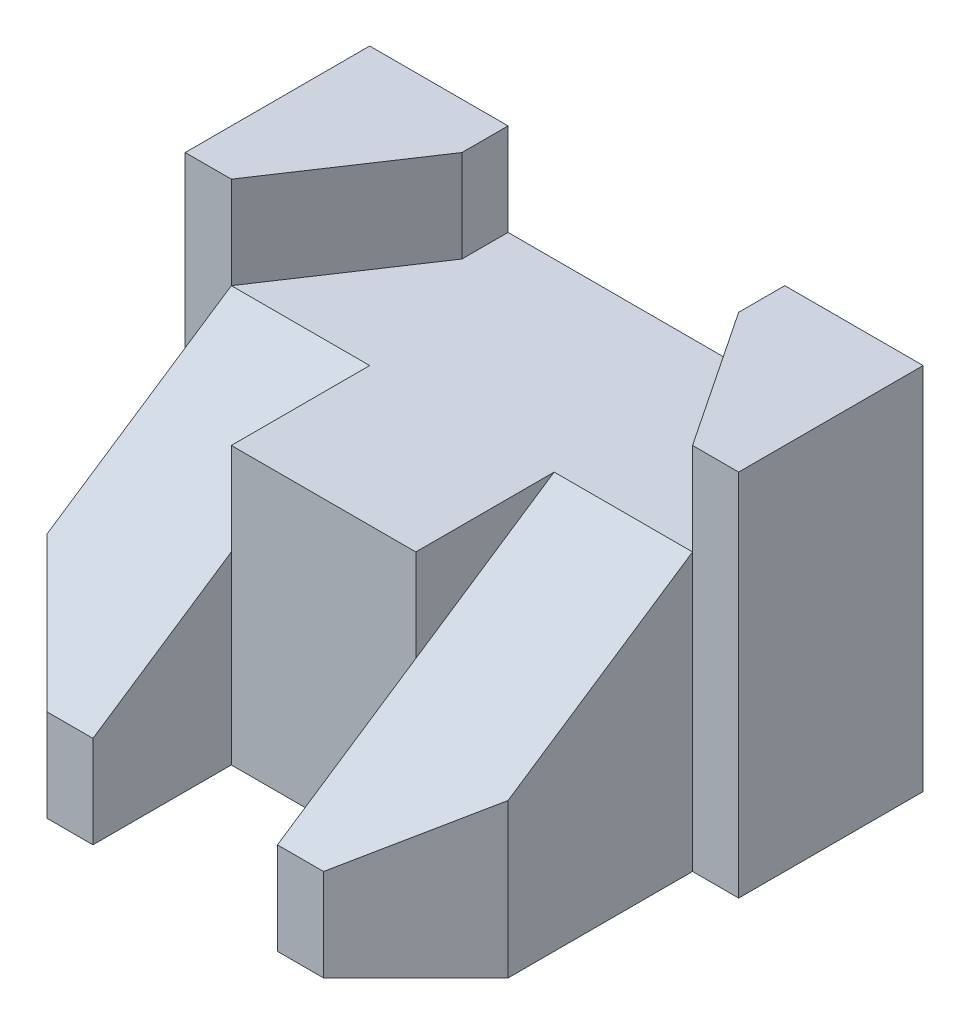
ISO-10303-21;
HEADER;
FILE_DESCRIPTION(('STEP AP214'),'2;1');
FILE_NAME('part.step','',(''),(''),'','','');
FILE_SCHEMA(('AUTOMOTIVE_DESIGN { 1 0 10303 214 1 1 1 1 }'));
ENDSEC;
DATA;
#1=APPLICATION_CONTEXT('core data for automotive mechanical design processes');
#2=APPLICATION_PROTOCOL_DEFINITION('international standard','automotive_design',2000,#1);
#3=PRODUCT_CONTEXT('',#1,'mechanical');
#4=PRODUCT('Part','Part','',(#3));
#5=PRODUCT_RELATED_PRODUCT_CATEGORY('part','',(#4));
#6=PRODUCT_DEFINITION_FORMATION('','',#4);
#7=PRODUCT_DEFINITION_CONTEXT('part definition',#1,'design');
#8=PRODUCT_DEFINITION('design','',#6,#7);
#9=PRODUCT_DEFINITION_SHAPE('','',#8);
#10=(LENGTH_UNIT() NAMED_UNIT(*) SI_UNIT(.MILLI.,.METRE.));
#11=(NAMED_UNIT(*) PLANE_ANGLE_UNIT() SI_UNIT($,.RADIAN.));
#12=(NAMED_UNIT(*) SI_UNIT($,.STERADIAN.) SOLID_ANGLE_UNIT());
#13=UNCERTAINTY_MEASURE_WITH_UNIT(LENGTH_MEASURE(1.E-05),#10,'distance_accuracy_value','');
#14=(GEOMETRIC_REPRESENTATION_CONTEXT(3) GLOBAL_UNCERTAINTY_ASSIGNED_CONTEXT((#13)) GLOBAL_UNIT_ASSIGNED_CONTEXT((#10,
#11,#12)) REPRESENTATION_CONTEXT('',''));
#15=CARTESIAN_POINT('',(0.,0.,0.));
#16=DIRECTION('',(0.,0.,1.));
#17=DIRECTION('',(1.,0.,0.));
#18=AXIS2_PLACEMENT_3D('',#15,#16,#17);
#19=CARTESIAN_POINT('',(0.,60.,0.));
#20=DIRECTION('',(0.,-1.,0.));
#21=DIRECTION('',(0.,0.,-1.));
#22=AXIS2_PLACEMENT_3D('',#19,#20,#21);
#23=PLANE('',#22);
#24=DIRECTION('',(1.,0.,0.));
#25=VECTOR('',#24,1.);
#26=CARTESIAN_POINT('',(80.,60.,-30.));
#27=LINE('',#26,#25);
#28=CARTESIAN_POINT('',(40.0006538410258,60.,-30.));
#29=VERTEX_POINT('',#28);
#30=CARTESIAN_POINT('',(80.,60.,-30.));
#31=VERTEX_POINT('',#30);
#32=EDGE_CURVE('E326',#29,#31,#27,.T.);
#33=ORIENTED_EDGE('',*,*,#32,.T.);
#34=DIRECTION('',(0.,0.,-1.));
#35=VECTOR('',#34,1.);
#36=CARTESIAN_POINT('',(80.,60.,0.));
#37=LINE('',#36,#35);
#38=CARTESIAN_POINT('',(80.,60.,-60.));
#39=VERTEX_POINT('',#38);
#40=EDGE_CURVE('E308',#31,#39,#37,.T.);
#41=ORIENTED_EDGE('',*,*,#40,.T.);
#42=DIRECTION('',(1.,0.,0.));
#43=VECTOR('',#42,1.);
#44=CARTESIAN_POINT('',(80.,60.,-60.));
#45=LINE('',#44,#43);
#46=CARTESIAN_POINT('',(109.999,60.,-60.));
#47=VERTEX_POINT('',#46);
#48=EDGE_CURVE('E393',#39,#47,#45,.T.);
#49=ORIENTED_EDGE('',*,*,#48,.T.);
#50=DIRECTION('',(-0.554680994621482,0.,-0.832063095086979));
#51=VECTOR('',#50,1.);
#52=CARTESIAN_POINT('',(109.999,60.,-60.));
#53=LINE('',#52,#51);
#54=CARTESIAN_POINT('',(90.,60.,-90.));
#55=VERTEX_POINT('',#54);
#56=EDGE_CURVE('E328',#47,#55,#53,.T.);
#57=ORIENTED_EDGE('',*,*,#56,.T.);
#58=DIRECTION('',(0.,0.,-1.));
#59=VECTOR('',#58,1.);
#60=CARTESIAN_POINT('',(90.,60.,-100.));
#61=LINE('',#60,#59);
#62=CARTESIAN_POINT('',(90.,60.,-100.));
#63=VERTEX_POINT('',#62);
#64=EDGE_CURVE('E331',#55,#63,#61,.T.);
#65=ORIENTED_EDGE('',*,*,#64,.T.);
#66=DIRECTION('',(-1.,0.,0.));
#67=VECTOR('',#66,1.);
#68=CARTESIAN_POINT('',(30.,60.,-100.));
#69=LINE('',#68,#67);
#70=CARTESIAN_POINT('',(30.,60.,-100.));
#71=VERTEX_POINT('',#70);
#72=EDGE_CURVE('E334',#63,#71,#69,.T.);
#73=ORIENTED_EDGE('',*,*,#72,.T.);
#74=DIRECTION('',(0.,0.,1.));
#75=VECTOR('',#74,1.);
#76=CARTESIAN_POINT('',(30.,60.,-90.));
#77=LINE('',#76,#75);
#78=CARTESIAN_POINT('',(30.,60.,-90.));
#79=VERTEX_POINT('',#78);
#80=EDGE_CURVE('E322',#71,#79,#77,.T.);
#81=ORIENTED_EDGE('',*,*,#80,.T.);
#82=DIRECTION('',(-0.554680994621483,0.,0.832063095086979));
#83=VECTOR('',#82,1.);
#84=CARTESIAN_POINT('',(10.001,60.,-60.));
#85=LINE('',#84,#83);
#86=CARTESIAN_POINT('',(10.001,60.,-60.));
#87=VERTEX_POINT('',#86);
#88=EDGE_CURVE('E306',#79,#87,#85,.T.);
#89=ORIENTED_EDGE('',*,*,#88,.T.);
#90=DIRECTION('',(-1.,0.,-5.55543559704748E-10));
#91=VECTOR('',#90,1.);
#92=CARTESIAN_POINT('',(10.,59.9999999999997,-60.0000000000002));
#93=LINE('',#92,#91);
#94=CARTESIAN_POINT('',(40.001,60.,-59.9999999833333));
#95=VERTEX_POINT('',#94);
#96=EDGE_CURVE('E296',#95,#87,#93,.T.);
#97=ORIENTED_EDGE('',*,*,#96,.F.);
#98=DIRECTION('',(1.15386324790428E-05,0.,-0.99999999993343));
#99=VECTOR('',#98,1.);
#100=CARTESIAN_POINT('',(40.0003076767258,60.,0.000461548849361099));
#101=LINE('',#100,#99);
#102=EDGE_CURVE('E41',#29,#95,#101,.T.);
#103=ORIENTED_EDGE('',*,*,#102,.F.);
#104=EDGE_LOOP('',(#33,#41,#49,#57,#65,#73,#81,#89,#97,#103));
#105=FACE_BOUND('',#104,.T.);
#106=ADVANCED_FACE('F33',(#105),#23,.F.);
#107=CARTESIAN_POINT('',(0.,80.,0.));
#108=DIRECTION('',(0.,0.,-1.));
#109=DIRECTION('',(-1.,0.,0.));
#110=AXIS2_PLACEMENT_3D('',#107,#108,#109);
#111=PLANE('',#110);
#112=DIRECTION('',(1.,2.56410402169986E-10,1.70940056091566E-10));
#113=VECTOR('',#112,1.);
#114=CARTESIAN_POINT('',(40.,20.,0.));
#115=LINE('',#114,#113);
#116=CARTESIAN_POINT('',(29.9999999982906,19.9999999974359,-1.70940374138813E-09));
#117=VERTEX_POINT('',#116);
#118=CARTESIAN_POINT('',(40.,20.,0.));
#119=VERTEX_POINT('',#118);
#120=EDGE_CURVE('E301',#117,#119,#115,.T.);
#121=ORIENTED_EDGE('',*,*,#120,.F.);
#122=DIRECTION('',(0.,1.,0.));
#123=VECTOR('',#122,1.);
#124=CARTESIAN_POINT('',(30.,0.,0.));
#125=LINE('',#124,#123);
#126=CARTESIAN_POINT('',(30.,0.,0.));
#127=VERTEX_POINT('',#126);
#128=EDGE_CURVE('E223',#127,#117,#125,.T.);
#129=ORIENTED_EDGE('',*,*,#128,.F.);
#130=DIRECTION('',(1.,0.,0.));
#131=VECTOR('',#130,1.);
#132=CARTESIAN_POINT('',(0.,0.,0.));
#133=LINE('',#132,#131);
#134=CARTESIAN_POINT('',(40.,0.,0.));
#135=VERTEX_POINT('',#134);
#136=EDGE_CURVE('E273',#127,#135,#133,.T.);
#137=ORIENTED_EDGE('',*,*,#136,.T.);
#138=DIRECTION('',(0.,1.,0.));
#139=VECTOR('',#138,1.);
#140=CARTESIAN_POINT('',(40.,0.,0.));
#141=LINE('',#140,#139);
#142=EDGE_CURVE('E250',#135,#119,#141,.T.);
#143=ORIENTED_EDGE('',*,*,#142,.T.);
#144=EDGE_LOOP('',(#121,#129,#137,#143));
#145=FACE_BOUND('',#144,.T.);
#146=ADVANCED_FACE('F415',(#145),#111,.F.);
#147=CARTESIAN_POINT('',(40.,0.,0.));
#148=DIRECTION('',(-1.,0.,0.));
#149=DIRECTION('',(0.,0.,1.));
#150=AXIS2_PLACEMENT_3D('',#147,#148,#149);
#151=PLANE('',#150);
#152=DIRECTION('',(0.,0.554700196331898,-0.832050294266731));
#153=VECTOR('',#152,1.);
#154=CARTESIAN_POINT('',(40.,13.8461538437871,9.2307692317554));
#155=LINE('',#154,#153);
#156=CARTESIAN_POINT('',(40.,40.0000000055554,-30.));
#157=VERTEX_POINT('',#156);
#158=EDGE_CURVE('E318',#119,#157,#155,.T.);
#159=ORIENTED_EDGE('',*,*,#158,.F.);
#160=ORIENTED_EDGE('',*,*,#142,.F.);
#161=DIRECTION('',(0.,0.,1.));
#162=VECTOR('',#161,1.);
#163=CARTESIAN_POINT('',(40.,0.,0.));
#164=LINE('',#163,#162);
#165=CARTESIAN_POINT('',(40.,0.,-30.));
#166=VERTEX_POINT('',#165);
#167=EDGE_CURVE('E242',#166,#135,#164,.T.);
#168=ORIENTED_EDGE('',*,*,#167,.F.);
#169=DIRECTION('',(0.,1.,0.));
#170=VECTOR('',#169,1.);
#171=CARTESIAN_POINT('',(40.,0.,-30.));
#172=LINE('',#171,#170);
#173=EDGE_CURVE('E253',#166,#157,#172,.T.);
#174=ORIENTED_EDGE('',*,*,#173,.T.);
#175=EDGE_LOOP('',(#159,#160,#168,#174));
#176=FACE_BOUND('',#175,.T.);
#177=ADVANCED_FACE('F412',(#176),#151,.F.);
#178=CARTESIAN_POINT('',(80.,0.,-30.));
#179=DIRECTION('',(0.,0.,-1.));
#180=DIRECTION('',(-1.,0.,0.));
#181=AXIS2_PLACEMENT_3D('',#178,#179,#180);
#182=PLANE('',#181);
#183=DIRECTION('',(7.69205128471533E-06,0.999999999970416,0.));
#184=VECTOR('',#183,1.);
#185=CARTESIAN_POINT('',(40.0001923203154,0.000307680572059986,-30.));
#186=LINE('',#185,#184);
#187=CARTESIAN_POINT('',(40.0005000000002,40.0000000055555,-30.));
#188=VERTEX_POINT('',#187);
#189=EDGE_CURVE('E289',#188,#29,#186,.T.);
#190=ORIENTED_EDGE('',*,*,#189,.F.);
#191=DIRECTION('',(1.,3.70370988747382E-10,0.));
#192=VECTOR('',#191,1.);
#193=CARTESIAN_POINT('',(79.9999999851852,40.0000000203702,-30.));
#194=LINE('',#193,#192);
#195=EDGE_CURVE('E299',#157,#188,#194,.T.);
#196=ORIENTED_EDGE('',*,*,#195,.F.);
#197=ORIENTED_EDGE('',*,*,#173,.F.);
#198=DIRECTION('',(-1.,0.,0.));
#199=VECTOR('',#198,1.);
#200=CARTESIAN_POINT('',(80.,0.,-30.));
#201=LINE('',#200,#199);
#202=CARTESIAN_POINT('',(80.,0.,-30.));
#203=VERTEX_POINT('',#202);
#204=EDGE_CURVE('E239',#203,#166,#201,.T.);
#205=ORIENTED_EDGE('',*,*,#204,.F.);
#206=DIRECTION('',(0.,1.,0.));
#207=VECTOR('',#206,1.);
#208=CARTESIAN_POINT('',(80.,0.,-30.));
#209=LINE('',#208,#207);
#210=CARTESIAN_POINT('',(80.,40.,-30.));
#211=VERTEX_POINT('',#210);
#212=EDGE_CURVE('E256',#203,#211,#209,.T.);
#213=ORIENTED_EDGE('',*,*,#212,.T.);
#214=EDGE_CURVE('E245',#211,#31,#209,.T.);
#215=ORIENTED_EDGE('',*,*,#214,.T.);
#216=ORIENTED_EDGE('',*,*,#32,.F.);
#217=EDGE_LOOP('',(#190,#196,#197,#205,#213,#215,#216));
#218=FACE_BOUND('',#217,.T.);
#219=ADVANCED_FACE('F404',(#218),#182,.F.);
#220=CARTESIAN_POINT('',(10.,0.,-60.));
#221=DIRECTION('',(1.,0.,0.));
#222=DIRECTION('',(0.,0.,-1.));
#223=AXIS2_PLACEMENT_3D('',#220,#221,#222);
#224=PLANE('',#223);
#225=DIRECTION('',(0.,-0.554700196331898,0.832050294266731));
#226=VECTOR('',#225,1.);
#227=CARTESIAN_POINT('',(10.,19.9999999923077,-5.12820341747044E-09));
#228=LINE('',#227,#226);
#229=CARTESIAN_POINT('',(10.,59.9999999999997,-60.0000000000002));
#230=VERTEX_POINT('',#229);
#231=CARTESIAN_POINT('',(10.,33.3333333259258,-20.));
#232=VERTEX_POINT('',#231);
#233=EDGE_CURVE('E307',#230,#232,#228,.T.);
#234=ORIENTED_EDGE('',*,*,#233,.F.);
#235=DIRECTION('',(0.,1.,0.));
#236=VECTOR('',#235,1.);
#237=CARTESIAN_POINT('',(10.,0.,-60.));
#238=LINE('',#237,#236);
#239=CARTESIAN_POINT('',(10.,0.,-60.));
#240=VERTEX_POINT('',#239);
#241=EDGE_CURVE('E229',#240,#230,#238,.T.);
#242=ORIENTED_EDGE('',*,*,#241,.F.);
#243=DIRECTION('',(0.,0.,-1.));
#244=VECTOR('',#243,1.);
#245=CARTESIAN_POINT('',(10.,0.,-60.));
#246=LINE('',#245,#244);
#247=CARTESIAN_POINT('',(10.,0.,-20.));
#248=VERTEX_POINT('',#247);
#249=EDGE_CURVE('E216',#248,#240,#246,.T.);
#250=ORIENTED_EDGE('',*,*,#249,.F.);
#251=DIRECTION('',(0.,1.,0.));
#252=VECTOR('',#251,1.);
#253=CARTESIAN_POINT('',(10.,0.,-20.));
#254=LINE('',#253,#252);
#255=EDGE_CURVE('E232',#248,#232,#254,.T.);
#256=ORIENTED_EDGE('',*,*,#255,.T.);
#257=EDGE_LOOP('',(#234,#242,#250,#256));
#258=FACE_BOUND('',#257,.T.);
#259=ADVANCED_FACE('F425',(#258),#224,.F.);
#260=CARTESIAN_POINT('',(10.,0.,-20.));
#261=DIRECTION('',(0.707106781186548,0.,-0.707106781186548));
#262=DIRECTION('',(-0.707106781186548,0.,-0.707106781186548));
#263=AXIS2_PLACEMENT_3D('',#260,#261,#262);
#264=PLANE('',#263);
#265=DIRECTION('',(0.639602149099136,-0.426401432614308,0.639602149099136));
#266=VECTOR('',#265,1.);
#267=CARTESIAN_POINT('',(19.0909090872818,27.2727272694215,-10.9090909127182));
#268=LINE('',#267,#266);
#269=EDGE_CURVE('E300',#232,#117,#268,.T.);
#270=ORIENTED_EDGE('',*,*,#269,.F.);
#271=ORIENTED_EDGE('',*,*,#255,.F.);
#272=DIRECTION('',(-0.707106781186548,0.,-0.707106781186548));
#273=VECTOR('',#272,1.);
#274=CARTESIAN_POINT('',(10.,0.,-20.));
#275=LINE('',#274,#273);
#276=EDGE_CURVE('E213',#127,#248,#275,.T.);
#277=ORIENTED_EDGE('',*,*,#276,.F.);
#278=ORIENTED_EDGE('',*,*,#128,.T.);
#279=EDGE_LOOP('',(#270,#271,#277,#278));
#280=FACE_BOUND('',#279,.T.);
#281=ADVANCED_FACE('F419',(#280),#264,.F.);
#282=CARTESIAN_POINT('',(0.,80.,0.));
#283=DIRECTION('',(0.,-1.,0.));
#284=DIRECTION('',(0.,0.,-1.));
#285=AXIS2_PLACEMENT_3D('',#282,#283,#284);
#286=PLANE('',#285);
#287=DIRECTION('',(-0.554680994621482,0.,-0.832063095086979));
#288=VECTOR('',#287,1.);
#289=CARTESIAN_POINT('',(109.999,80.,-60.));
#290=LINE('',#289,#288);
#291=CARTESIAN_POINT('',(109.999,80.,-60.));
#292=VERTEX_POINT('',#291);
#293=CARTESIAN_POINT('',(90.,80.,-90.));
#294=VERTEX_POINT('',#293);
#295=EDGE_CURVE('E343',#292,#294,#290,.T.);
#296=ORIENTED_EDGE('',*,*,#295,.F.);
#297=DIRECTION('',(-1.,0.,0.));
#298=VECTOR('',#297,1.);
#299=CARTESIAN_POINT('',(120.,80.,-60.));
#300=LINE('',#299,#298);
#301=CARTESIAN_POINT('',(120.,80.,-60.));
#302=VERTEX_POINT('',#301);
#303=EDGE_CURVE('E349',#302,#292,#300,.T.);
#304=ORIENTED_EDGE('',*,*,#303,.F.);
#305=DIRECTION('',(0.,0.,-1.));
#306=VECTOR('',#305,1.);
#307=CARTESIAN_POINT('',(120.,80.,0.));
#308=LINE('',#307,#306);
#309=CARTESIAN_POINT('',(120.,80.,-100.));
#310=VERTEX_POINT('',#309);
#311=EDGE_CURVE('E262',#302,#310,#308,.T.);
#312=ORIENTED_EDGE('',*,*,#311,.T.);
#313=DIRECTION('',(-1.,0.,0.));
#314=VECTOR('',#313,1.);
#315=CARTESIAN_POINT('',(0.,80.,-100.));
#316=LINE('',#315,#314);
#317=CARTESIAN_POINT('',(90.,80.,-100.));
#318=VERTEX_POINT('',#317);
#319=EDGE_CURVE('E266',#310,#318,#316,.T.);
#320=ORIENTED_EDGE('',*,*,#319,.T.);
#321=DIRECTION('',(0.,0.,-1.));
#322=VECTOR('',#321,1.);
#323=CARTESIAN_POINT('',(90.,80.,-100.));
#324=LINE('',#323,#322);
#325=EDGE_CURVE('E324',#294,#318,#324,.T.);
#326=ORIENTED_EDGE('',*,*,#325,.F.);
#327=EDGE_LOOP('',(#296,#304,#312,#320,#326));
#328=FACE_BOUND('',#327,.T.);
#329=ADVANCED_FACE('F387',(#328),#286,.F.);
#330=DIRECTION('',(0.,1.,0.));
#331=VECTOR('',#330,1.);
#332=CARTESIAN_POINT('',(90.,0.,0.));
#333=LINE('',#332,#331);
#334=CARTESIAN_POINT('',(90.,0.,0.));
#335=VERTEX_POINT('',#334);
#336=CARTESIAN_POINT('',(90.,20.,0.));
#337=VERTEX_POINT('',#336);
#338=EDGE_CURVE('E207',#335,#337,#333,.T.);
#339=ORIENTED_EDGE('',*,*,#338,.T.);
#340=DIRECTION('',(-1.,0.,0.));
#341=VECTOR('',#340,1.);
#342=CARTESIAN_POINT('',(109.999,20.,0.));
#343=LINE('',#342,#341);
#344=CARTESIAN_POINT('',(80.,20.,0.));
#345=VERTEX_POINT('',#344);
#346=EDGE_CURVE('E48',#337,#345,#343,.T.);
#347=ORIENTED_EDGE('',*,*,#346,.T.);
#348=DIRECTION('',(0.,1.,0.));
#349=VECTOR('',#348,1.);
#350=CARTESIAN_POINT('',(80.,0.,0.));
#351=LINE('',#350,#349);
#352=CARTESIAN_POINT('',(80.,0.,0.));
#353=VERTEX_POINT('',#352);
#354=EDGE_CURVE('E246',#353,#345,#351,.T.);
#355=ORIENTED_EDGE('',*,*,#354,.F.);
#356=EDGE_CURVE('E272',#353,#335,#133,.T.);
#357=ORIENTED_EDGE('',*,*,#356,.T.);
#358=EDGE_LOOP('',(#339,#347,#355,#357));
#359=FACE_BOUND('',#358,.T.);
#360=ADVANCED_FACE('F368',(#359),#111,.F.);
#361=CARTESIAN_POINT('',(0.,80.,0.));
#362=DIRECTION('',(1.,0.,0.));
#363=DIRECTION('',(0.,0.,-1.));
#364=AXIS2_PLACEMENT_3D('',#361,#362,#363);
#365=PLANE('',#364);
#366=DIRECTION('',(0.,0.,1.));
#367=VECTOR('',#366,1.);
#368=CARTESIAN_POINT('',(0.,0.,0.));
#369=LINE('',#368,#367);
#370=CARTESIAN_POINT('',(0.,0.,-100.));
#371=VERTEX_POINT('',#370);
#372=CARTESIAN_POINT('',(0.,0.,-60.));
#373=VERTEX_POINT('',#372);
#374=EDGE_CURVE('E249',#371,#373,#369,.T.);
#375=ORIENTED_EDGE('',*,*,#374,.T.);
#376=DIRECTION('',(0.,1.,0.));
#377=VECTOR('',#376,1.);
#378=CARTESIAN_POINT('',(0.,0.,-60.));
#379=LINE('',#378,#377);
#380=CARTESIAN_POINT('',(0.,80.,-60.));
#381=VERTEX_POINT('',#380);
#382=EDGE_CURVE('E226',#373,#381,#379,.T.);
#383=ORIENTED_EDGE('',*,*,#382,.T.);
#384=DIRECTION('',(0.,0.,1.));
#385=VECTOR('',#384,1.);
#386=CARTESIAN_POINT('',(0.,80.,0.));
#387=LINE('',#386,#385);
#388=CARTESIAN_POINT('',(0.,80.,-100.));
#389=VERTEX_POINT('',#388);
#390=EDGE_CURVE('E259',#389,#381,#387,.T.);
#391=ORIENTED_EDGE('',*,*,#390,.F.);
#392=DIRECTION('',(0.,-1.,0.));
#393=VECTOR('',#392,1.);
#394=CARTESIAN_POINT('',(0.,80.,-100.));
#395=LINE('',#394,#393);
#396=EDGE_CURVE('E269',#389,#371,#395,.T.);
#397=ORIENTED_EDGE('',*,*,#396,.T.);
#398=EDGE_LOOP('',(#375,#383,#391,#397));
#399=FACE_BOUND('',#398,.T.);
#400=ADVANCED_FACE('F35',(#399),#365,.F.);
#401=CARTESIAN_POINT('',(120.,80.,0.));
#402=DIRECTION('',(-1.,0.,0.));
#403=DIRECTION('',(0.,0.,1.));
#404=AXIS2_PLACEMENT_3D('',#401,#402,#403);
#405=PLANE('',#404);
#406=ORIENTED_EDGE('',*,*,#311,.F.);
#407=DIRECTION('',(0.,1.,0.));
#408=VECTOR('',#407,1.);
#409=CARTESIAN_POINT('',(120.,0.,-60.));
#410=LINE('',#409,#408);
#411=CARTESIAN_POINT('',(120.,0.,-60.));
#412=VERTEX_POINT('',#411);
#413=EDGE_CURVE('E205',#412,#302,#410,.T.);
#414=ORIENTED_EDGE('',*,*,#413,.F.);
#415=DIRECTION('',(0.,0.,-1.));
#416=VECTOR('',#415,1.);
#417=CARTESIAN_POINT('',(120.,0.,0.));
#418=LINE('',#417,#416);
#419=CARTESIAN_POINT('',(120.,0.,-100.));
#420=VERTEX_POINT('',#419);
#421=EDGE_CURVE('E275',#412,#420,#418,.T.);
#422=ORIENTED_EDGE('',*,*,#421,.T.);
#423=DIRECTION('',(0.,-1.,0.));
#424=VECTOR('',#423,1.);
#425=CARTESIAN_POINT('',(120.,80.,-100.));
#426=LINE('',#425,#424);
#427=EDGE_CURVE('E280',#310,#420,#426,.T.);
#428=ORIENTED_EDGE('',*,*,#427,.F.);
#429=EDGE_LOOP('',(#406,#414,#422,#428));
#430=FACE_BOUND('',#429,.T.);
#431=ADVANCED_FACE('F382',(#430),#405,.F.);
#432=CARTESIAN_POINT('',(0.,80.,-100.));
#433=DIRECTION('',(0.,0.,1.));
#434=DIRECTION('',(1.,0.,0.));
#435=AXIS2_PLACEMENT_3D('',#432,#433,#434);
#436=PLANE('',#435);
#437=CARTESIAN_POINT('',(30.,80.,-100.));
#438=VERTEX_POINT('',#437);
#439=EDGE_CURVE('E265',#438,#389,#316,.T.);
#440=ORIENTED_EDGE('',*,*,#439,.F.);
#441=DIRECTION('',(0.,1.,0.));
#442=VECTOR('',#441,1.);
#443=CARTESIAN_POINT('',(30.,60.,-100.));
#444=LINE('',#443,#442);
#445=EDGE_CURVE('E347',#71,#438,#444,.T.);
#446=ORIENTED_EDGE('',*,*,#445,.F.);
#447=ORIENTED_EDGE('',*,*,#72,.F.);
#448=DIRECTION('',(0.,1.,0.));
#449=VECTOR('',#448,1.);
#450=CARTESIAN_POINT('',(90.,60.,-100.));
#451=LINE('',#450,#449);
#452=EDGE_CURVE('E350',#63,#318,#451,.T.);
#453=ORIENTED_EDGE('',*,*,#452,.T.);
#454=ORIENTED_EDGE('',*,*,#319,.F.);
#455=ORIENTED_EDGE('',*,*,#427,.T.);
#456=DIRECTION('',(-1.,0.,0.));
#457=VECTOR('',#456,1.);
#458=CARTESIAN_POINT('',(0.,0.,-100.));
#459=LINE('',#458,#457);
#460=EDGE_CURVE('E263',#420,#371,#459,.T.);
#461=ORIENTED_EDGE('',*,*,#460,.T.);
#462=ORIENTED_EDGE('',*,*,#396,.F.);
#463=EDGE_LOOP('',(#440,#446,#447,#453,#454,#455,#461,#462));
#464=FACE_BOUND('',#463,.T.);
#465=ADVANCED_FACE('F433',(#464),#436,.F.);
#466=DIRECTION('',(-1.,0.,0.));
#467=VECTOR('',#466,1.);
#468=CARTESIAN_POINT('',(0.,80.,-60.));
#469=LINE('',#468,#467);
#470=CARTESIAN_POINT('',(10.001,80.,-60.));
#471=VERTEX_POINT('',#470);
#472=EDGE_CURVE('E217',#471,#381,#469,.T.);
#473=ORIENTED_EDGE('',*,*,#472,.F.);
#474=DIRECTION('',(-0.554680994621483,0.,0.832063095086979));
#475=VECTOR('',#474,1.);
#476=CARTESIAN_POINT('',(10.001,80.,-60.));
#477=LINE('',#476,#475);
#478=CARTESIAN_POINT('',(30.,80.,-90.));
#479=VERTEX_POINT('',#478);
#480=EDGE_CURVE('E340',#479,#471,#477,.T.);
#481=ORIENTED_EDGE('',*,*,#480,.F.);
#482=DIRECTION('',(0.,0.,1.));
#483=VECTOR('',#482,1.);
#484=CARTESIAN_POINT('',(30.,80.,-90.));
#485=LINE('',#484,#483);
#486=EDGE_CURVE('E200',#438,#479,#485,.T.);
#487=ORIENTED_EDGE('',*,*,#486,.F.);
#488=ORIENTED_EDGE('',*,*,#439,.T.);
#489=ORIENTED_EDGE('',*,*,#390,.T.);
#490=EDGE_LOOP('',(#473,#481,#487,#488,#489));
#491=FACE_BOUND('',#490,.T.);
#492=ADVANCED_FACE('F612',(#491),#286,.F.);
#493=CARTESIAN_POINT('',(0.,0.,0.));
#494=DIRECTION('',(0.,-1.,0.));
#495=DIRECTION('',(0.,0.,-1.));
#496=AXIS2_PLACEMENT_3D('',#493,#494,#495);
#497=PLANE('',#496);
#498=DIRECTION('',(-0.707106781186547,0.,0.707106781186548));
#499=VECTOR('',#498,1.);
#500=CARTESIAN_POINT('',(110.,0.,-20.));
#501=LINE('',#500,#499);
#502=CARTESIAN_POINT('',(110.,0.,-20.));
#503=VERTEX_POINT('',#502);
#504=EDGE_CURVE('E209',#503,#335,#501,.T.);
#505=ORIENTED_EDGE('',*,*,#504,.T.);
#506=ORIENTED_EDGE('',*,*,#356,.F.);
#507=DIRECTION('',(0.,0.,-1.));
#508=VECTOR('',#507,1.);
#509=CARTESIAN_POINT('',(80.,0.,0.));
#510=LINE('',#509,#508);
#511=EDGE_CURVE('E228',#353,#203,#510,.T.);
#512=ORIENTED_EDGE('',*,*,#511,.T.);
#513=ORIENTED_EDGE('',*,*,#204,.T.);
#514=ORIENTED_EDGE('',*,*,#167,.T.);
#515=ORIENTED_EDGE('',*,*,#136,.F.);
#516=ORIENTED_EDGE('',*,*,#276,.T.);
#517=ORIENTED_EDGE('',*,*,#249,.T.);
#518=DIRECTION('',(-1.,0.,0.));
#519=VECTOR('',#518,1.);
#520=CARTESIAN_POINT('',(0.,0.,-60.));
#521=LINE('',#520,#519);
#522=EDGE_CURVE('E220',#240,#373,#521,.T.);
#523=ORIENTED_EDGE('',*,*,#522,.T.);
#524=ORIENTED_EDGE('',*,*,#374,.F.);
#525=ORIENTED_EDGE('',*,*,#460,.F.);
#526=ORIENTED_EDGE('',*,*,#421,.F.);
#527=DIRECTION('',(-1.,0.,0.));
#528=VECTOR('',#527,1.);
#529=CARTESIAN_POINT('',(120.,0.,-60.));
#530=LINE('',#529,#528);
#531=CARTESIAN_POINT('',(110.,0.,-60.));
#532=VERTEX_POINT('',#531);
#533=EDGE_CURVE('E360',#412,#532,#530,.T.);
#534=ORIENTED_EDGE('',*,*,#533,.T.);
#535=DIRECTION('',(0.,0.,1.));
#536=VECTOR('',#535,1.);
#537=CARTESIAN_POINT('',(110.,0.,-60.));
#538=LINE('',#537,#536);
#539=EDGE_CURVE('E55',#532,#503,#538,.T.);
#540=ORIENTED_EDGE('',*,*,#539,.T.);
#541=EDGE_LOOP('',(#505,#506,#512,#513,#514,#515,#516,#517,#523,#524,#525,#526,#534,#540));
#542=FACE_BOUND('',#541,.T.);
#543=ADVANCED_FACE('F375',(#542),#497,.T.);
#544=CARTESIAN_POINT('',(80.,0.,0.));
#545=DIRECTION('',(1.,0.,0.));
#546=DIRECTION('',(0.,0.,-1.));
#547=AXIS2_PLACEMENT_3D('',#544,#545,#546);
#548=PLANE('',#547);
#549=ORIENTED_EDGE('',*,*,#354,.T.);
#550=DIRECTION('',(0.,0.554700196225229,-0.832050294337843));
#551=VECTOR('',#550,1.);
#552=CARTESIAN_POINT('',(80.,20.,0.));
#553=LINE('',#552,#551);
#554=EDGE_CURVE('E395',#345,#211,#553,.T.);
#555=ORIENTED_EDGE('',*,*,#554,.T.);
#556=ORIENTED_EDGE('',*,*,#212,.F.);
#557=ORIENTED_EDGE('',*,*,#511,.F.);
#558=EDGE_LOOP('',(#549,#555,#556,#557));
#559=FACE_BOUND('',#558,.T.);
#560=ADVANCED_FACE('F407',(#559),#548,.F.);
#561=CARTESIAN_POINT('',(0.,0.,-60.));
#562=DIRECTION('',(0.,0.,-1.));
#563=DIRECTION('',(-1.,0.,0.));
#564=AXIS2_PLACEMENT_3D('',#561,#562,#563);
#565=PLANE('',#564);
#566=ORIENTED_EDGE('',*,*,#241,.T.);
#567=DIRECTION('',(1.,0.,0.));
#568=VECTOR('',#567,1.);
#569=CARTESIAN_POINT('',(-57.999,60.,-60.));
#570=LINE('',#569,#568);
#571=EDGE_CURVE('E201',#230,#87,#570,.T.);
#572=ORIENTED_EDGE('',*,*,#571,.T.);
#573=DIRECTION('',(0.,1.,0.));
#574=VECTOR('',#573,1.);
#575=CARTESIAN_POINT('',(10.001,60.,-60.));
#576=LINE('',#575,#574);
#577=EDGE_CURVE('E356',#87,#471,#576,.T.);
#578=ORIENTED_EDGE('',*,*,#577,.T.);
#579=ORIENTED_EDGE('',*,*,#472,.T.);
#580=ORIENTED_EDGE('',*,*,#382,.F.);
#581=ORIENTED_EDGE('',*,*,#522,.F.);
#582=EDGE_LOOP('',(#566,#572,#578,#579,#580,#581));
#583=FACE_BOUND('',#582,.T.);
#584=ADVANCED_FACE('F427',(#583),#565,.F.);
#585=CARTESIAN_POINT('',(110.,0.,-20.));
#586=DIRECTION('',(-0.707106781186548,0.,-0.707106781186547));
#587=DIRECTION('',(-0.707106781186547,0.,0.707106781186548));
#588=AXIS2_PLACEMENT_3D('',#585,#586,#587);
#589=PLANE('',#588);
#590=DIRECTION('',(0.,1.,0.));
#591=VECTOR('',#590,1.);
#592=CARTESIAN_POINT('',(110.,0.,-20.));
#593=LINE('',#592,#591);
#594=CARTESIAN_POINT('',(110.,33.3333333333334,-20.));
#595=VERTEX_POINT('',#594);
#596=EDGE_CURVE('E204',#503,#595,#593,.T.);
#597=ORIENTED_EDGE('',*,*,#596,.T.);
#598=DIRECTION('',(-0.639602149066831,-0.426401432711221,0.639602149066831));
#599=VECTOR('',#598,1.);
#600=CARTESIAN_POINT('',(100.909090909091,27.2727272727273,-10.9090909090909));
#601=LINE('',#600,#599);
#602=EDGE_CURVE('E11',#595,#337,#601,.T.);
#603=ORIENTED_EDGE('',*,*,#602,.T.);
#604=ORIENTED_EDGE('',*,*,#338,.F.);
#605=ORIENTED_EDGE('',*,*,#504,.F.);
#606=EDGE_LOOP('',(#597,#603,#604,#605));
#607=FACE_BOUND('',#606,.T.);
#608=ADVANCED_FACE('F373',(#607),#589,.F.);
#609=CARTESIAN_POINT('',(110.,0.,-60.));
#610=DIRECTION('',(-1.,0.,0.));
#611=DIRECTION('',(0.,0.,1.));
#612=AXIS2_PLACEMENT_3D('',#609,#610,#611);
#613=PLANE('',#612);
#614=DIRECTION('',(0.,1.,0.));
#615=VECTOR('',#614,1.);
#616=CARTESIAN_POINT('',(110.,0.,-60.));
#617=LINE('',#616,#615);
#618=CARTESIAN_POINT('',(110.,60.,-60.));
#619=VERTEX_POINT('',#618);
#620=EDGE_CURVE('E195',#532,#619,#617,.T.);
#621=ORIENTED_EDGE('',*,*,#620,.T.);
#622=DIRECTION('',(0.,-0.554700196225229,0.832050294337844));
#623=VECTOR('',#622,1.);
#624=CARTESIAN_POINT('',(110.,41.5384615384616,-32.3076923076923));
#625=LINE('',#624,#623);
#626=EDGE_CURVE('E183',#619,#595,#625,.T.);
#627=ORIENTED_EDGE('',*,*,#626,.T.);
#628=ORIENTED_EDGE('',*,*,#596,.F.);
#629=ORIENTED_EDGE('',*,*,#539,.F.);
#630=EDGE_LOOP('',(#621,#627,#628,#629));
#631=FACE_BOUND('',#630,.T.);
#632=ADVANCED_FACE('F203',(#631),#613,.F.);
#633=CARTESIAN_POINT('',(120.,0.,-60.));
#634=DIRECTION('',(0.,0.,-1.));
#635=DIRECTION('',(-1.,0.,0.));
#636=AXIS2_PLACEMENT_3D('',#633,#634,#635);
#637=PLANE('',#636);
#638=ORIENTED_EDGE('',*,*,#413,.T.);
#639=ORIENTED_EDGE('',*,*,#303,.T.);
#640=DIRECTION('',(0.,1.,0.));
#641=VECTOR('',#640,1.);
#642=CARTESIAN_POINT('',(109.999,60.,-60.));
#643=LINE('',#642,#641);
#644=EDGE_CURVE('E198',#47,#292,#643,.T.);
#645=ORIENTED_EDGE('',*,*,#644,.F.);
#646=DIRECTION('',(-1.,0.,0.));
#647=VECTOR('',#646,1.);
#648=CARTESIAN_POINT('',(177.999,60.,-60.));
#649=LINE('',#648,#647);
#650=EDGE_CURVE('E187',#619,#47,#649,.T.);
#651=ORIENTED_EDGE('',*,*,#650,.F.);
#652=ORIENTED_EDGE('',*,*,#620,.F.);
#653=ORIENTED_EDGE('',*,*,#533,.F.);
#654=EDGE_LOOP('',(#638,#639,#645,#651,#652,#653));
#655=FACE_BOUND('',#654,.T.);
#656=ADVANCED_FACE('F194',(#655),#637,.F.);
#657=CARTESIAN_POINT('',(30.,60.,-90.));
#658=DIRECTION('',(-1.,0.,0.));
#659=DIRECTION('',(0.,0.,1.));
#660=AXIS2_PLACEMENT_3D('',#657,#658,#659);
#661=PLANE('',#660);
#662=ORIENTED_EDGE('',*,*,#486,.T.);
#663=DIRECTION('',(0.,1.,0.));
#664=VECTOR('',#663,1.);
#665=CARTESIAN_POINT('',(30.,60.,-90.));
#666=LINE('',#665,#664);
#667=EDGE_CURVE('E337',#79,#479,#666,.T.);
#668=ORIENTED_EDGE('',*,*,#667,.F.);
#669=ORIENTED_EDGE('',*,*,#80,.F.);
#670=ORIENTED_EDGE('',*,*,#445,.T.);
#671=EDGE_LOOP('',(#662,#668,#669,#670));
#672=FACE_BOUND('',#671,.T.);
#673=ADVANCED_FACE('F438',(#672),#661,.F.);
#674=CARTESIAN_POINT('',(90.,60.,-100.));
#675=DIRECTION('',(1.,0.,0.));
#676=DIRECTION('',(0.,0.,-1.));
#677=AXIS2_PLACEMENT_3D('',#674,#675,#676);
#678=PLANE('',#677);
#679=ORIENTED_EDGE('',*,*,#325,.T.);
#680=ORIENTED_EDGE('',*,*,#452,.F.);
#681=ORIENTED_EDGE('',*,*,#64,.F.);
#682=DIRECTION('',(0.,1.,0.));
#683=VECTOR('',#682,1.);
#684=CARTESIAN_POINT('',(90.,60.,-90.));
#685=LINE('',#684,#683);
#686=EDGE_CURVE('E353',#55,#294,#685,.T.);
#687=ORIENTED_EDGE('',*,*,#686,.T.);
#688=EDGE_LOOP('',(#679,#680,#681,#687));
#689=FACE_BOUND('',#688,.T.);
#690=ADVANCED_FACE('F436',(#689),#678,.F.);
#691=CARTESIAN_POINT('',(109.999,60.,-60.));
#692=DIRECTION('',(0.832063095086979,0.,-0.554680994621482));
#693=DIRECTION('',(-0.554680994621482,0.,-0.832063095086979));
#694=AXIS2_PLACEMENT_3D('',#691,#692,#693);
#695=PLANE('',#694);
#696=ORIENTED_EDGE('',*,*,#295,.T.);
#697=ORIENTED_EDGE('',*,*,#686,.F.);
#698=ORIENTED_EDGE('',*,*,#56,.F.);
#699=ORIENTED_EDGE('',*,*,#644,.T.);
#700=EDGE_LOOP('',(#696,#697,#698,#699));
#701=FACE_BOUND('',#700,.T.);
#702=ADVANCED_FACE('F390',(#701),#695,.F.);
#703=CARTESIAN_POINT('',(10.001,60.,-60.));
#704=DIRECTION('',(-0.832063095086979,0.,-0.554680994621483));
#705=DIRECTION('',(-0.554680994621483,0.,0.832063095086979));
#706=AXIS2_PLACEMENT_3D('',#703,#704,#705);
#707=PLANE('',#706);
#708=ORIENTED_EDGE('',*,*,#480,.T.);
#709=ORIENTED_EDGE('',*,*,#577,.F.);
#710=ORIENTED_EDGE('',*,*,#88,.F.);
#711=ORIENTED_EDGE('',*,*,#667,.T.);
#712=EDGE_LOOP('',(#708,#709,#710,#711));
#713=FACE_BOUND('',#712,.T.);
#714=ADVANCED_FACE('F444',(#713),#707,.F.);
#715=CARTESIAN_POINT('',(40.0009999790447,116.579420010138,-22.2803866327642));
#716=DIRECTION('',(-0.999999999903846,7.69205128420327E-06,-1.15386324787015E-05));
#717=DIRECTION('',(-1.15386324790428E-05,0.,0.99999999993343));
#718=AXIS2_PLACEMENT_3D('',#715,#716,#717);
#719=PLANE('',#718);
#720=ORIENTED_EDGE('',*,*,#189,.T.);
#721=ORIENTED_EDGE('',*,*,#102,.T.);
#722=DIRECTION('',(1.38675049068818E-05,0.554700196278565,-0.832050294186724));
#723=VECTOR('',#722,1.);
#724=CARTESIAN_POINT('',(40.001,60.,-59.9999999833333));
#725=LINE('',#724,#723);
#726=EDGE_CURVE('E287',#188,#95,#725,.T.);
#727=ORIENTED_EDGE('',*,*,#726,.F.);
#728=EDGE_LOOP('',(#720,#721,#727));
#729=FACE_BOUND('',#728,.T.);
#730=ADVANCED_FACE('F286',(#729),#719,.T.);
#731=CARTESIAN_POINT('',(-5.12821288503149E-09,13.8461538335306,9.23076922491778));
#732=DIRECTION('',(-3.08167242062546E-10,0.832050294266731,0.554700196331898));
#733=DIRECTION('',(0.,-0.554700196331898,0.832050294266731));
#734=AXIS2_PLACEMENT_3D('',#731,#732,#733);
#735=PLANE('',#734);
#736=ORIENTED_EDGE('',*,*,#158,.T.);
#737=ORIENTED_EDGE('',*,*,#195,.T.);
#738=ORIENTED_EDGE('',*,*,#726,.T.);
#739=ORIENTED_EDGE('',*,*,#96,.T.);
#740=ORIENTED_EDGE('',*,*,#571,.F.);
#741=ORIENTED_EDGE('',*,*,#233,.T.);
#742=ORIENTED_EDGE('',*,*,#269,.T.);
#743=ORIENTED_EDGE('',*,*,#120,.T.);
#744=EDGE_LOOP('',(#736,#737,#738,#739,#740,#741,#742,#743));
#745=FACE_BOUND('',#744,.T.);
#746=ADVANCED_FACE('F295',(#745),#735,.T.);
#747=CARTESIAN_POINT('',(80.,76.5794200149734,37.7196133433156));
#748=DIRECTION('',(-1.,0.,0.));
#749=DIRECTION('',(0.,0.,1.));
#750=AXIS2_PLACEMENT_3D('',#747,#748,#749);
#751=PLANE('',#750);
#752=ORIENTED_EDGE('',*,*,#214,.F.);
#753=EDGE_CURVE('E190',#211,#39,#553,.T.);
#754=ORIENTED_EDGE('',*,*,#753,.T.);
#755=ORIENTED_EDGE('',*,*,#40,.F.);
#756=EDGE_LOOP('',(#752,#754,#755));
#757=FACE_BOUND('',#756,.T.);
#758=ADVANCED_FACE('F401',(#757),#751,.F.);
#759=CARTESIAN_POINT('',(0.,13.8461538461539,9.23076923076924));
#760=DIRECTION('',(0.,-0.832050294337844,-0.554700196225229));
#761=DIRECTION('',(0.,0.554700196225229,-0.832050294337844));
#762=AXIS2_PLACEMENT_3D('',#759,#760,#761);
#763=PLANE('',#762);
#764=ORIENTED_EDGE('',*,*,#602,.F.);
#765=ORIENTED_EDGE('',*,*,#626,.F.);
#766=ORIENTED_EDGE('',*,*,#650,.T.);
#767=ORIENTED_EDGE('',*,*,#48,.F.);
#768=ORIENTED_EDGE('',*,*,#753,.F.);
#769=ORIENTED_EDGE('',*,*,#554,.F.);
#770=ORIENTED_EDGE('',*,*,#346,.F.);
#771=EDGE_LOOP('',(#764,#765,#766,#767,#768,#769,#770));
#772=FACE_BOUND('',#771,.T.);
#773=ADVANCED_FACE('F185',(#772),#763,.F.);
#774=CLOSED_SHELL('',(#106,#146,#177,#219,#259,#281,#329,#360,#400,#431,#465,#492,#543,#560,
#584,#608,#632,#656,#673,#690,#702,#714,#730,#746,#758,#773));
#775=MANIFOLD_SOLID_BREP('B2',#774);
#776=ADVANCED_BREP_SHAPE_REPRESENTATION('',(#18,#775),#14);
#777=SHAPE_DEFINITION_REPRESENTATION(#9,#776);
ENDSEC;
END-ISO-10303-21;
